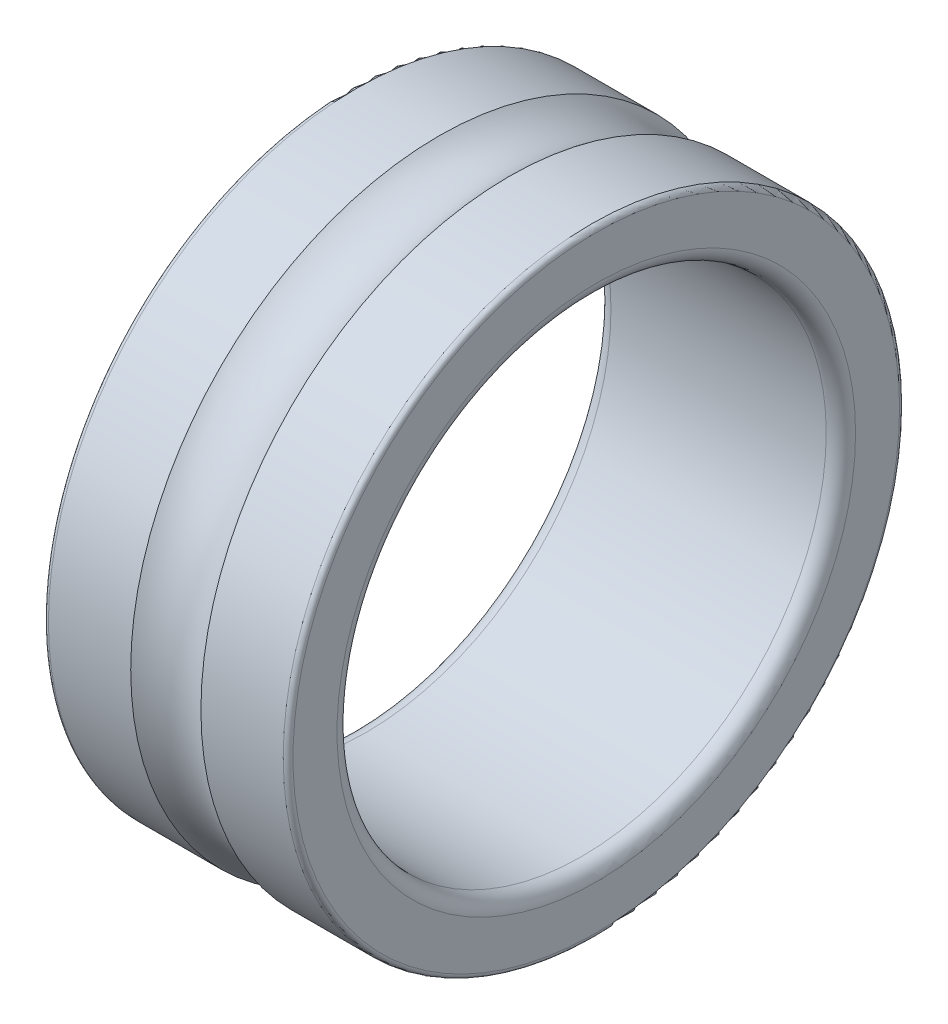
ISO-10303-21;
HEADER;
FILE_DESCRIPTION(('STEP AP214'),'2;1');
FILE_NAME('part.step','',(''),(''),'','','');
FILE_SCHEMA(('AUTOMOTIVE_DESIGN { 1 0 10303 214 1 1 1 1 }'));
ENDSEC;
DATA;
#1=APPLICATION_CONTEXT('core data for automotive mechanical design processes');
#2=APPLICATION_PROTOCOL_DEFINITION('international standard','automotive_design',2000,#1);
#3=PRODUCT_CONTEXT('',#1,'mechanical');
#4=PRODUCT('Part','Part','',(#3));
#5=PRODUCT_RELATED_PRODUCT_CATEGORY('part','',(#4));
#6=PRODUCT_DEFINITION_FORMATION('','',#4);
#7=PRODUCT_DEFINITION_CONTEXT('part definition',#1,'design');
#8=PRODUCT_DEFINITION('design','',#6,#7);
#9=PRODUCT_DEFINITION_SHAPE('','',#8);
#10=(LENGTH_UNIT() NAMED_UNIT(*) SI_UNIT(.MILLI.,.METRE.));
#11=(NAMED_UNIT(*) PLANE_ANGLE_UNIT() SI_UNIT($,.RADIAN.));
#12=(NAMED_UNIT(*) SI_UNIT($,.STERADIAN.) SOLID_ANGLE_UNIT());
#13=UNCERTAINTY_MEASURE_WITH_UNIT(LENGTH_MEASURE(1.E-05),#10,'distance_accuracy_value','');
#14=(GEOMETRIC_REPRESENTATION_CONTEXT(3) GLOBAL_UNCERTAINTY_ASSIGNED_CONTEXT((#13)) GLOBAL_UNIT_ASSIGNED_CONTEXT((#10,
#11,#12)) REPRESENTATION_CONTEXT('',''));
#15=CARTESIAN_POINT('',(0.,0.,0.));
#16=DIRECTION('',(0.,0.,1.));
#17=DIRECTION('',(1.,0.,0.));
#18=AXIS2_PLACEMENT_3D('',#15,#16,#17);
#19=CARTESIAN_POINT('',(0.,0.,0.));
#20=DIRECTION('',(1.,0.,0.));
#21=DIRECTION('',(0.,0.,-1.));
#22=AXIS2_PLACEMENT_3D('',#19,#20,#21);
#23=TOROIDAL_SURFACE('',#22,7.25,1.1905);
#24=CARTESIAN_POINT('',(-0.717488850087581,0.,0.));
#25=DIRECTION('',(-1.,0.,0.));
#26=DIRECTION('',(0.,0.,1.));
#27=AXIS2_PLACEMENT_3D('',#24,#25,#26);
#28=CIRCLE('',#27,6.3);
#29=CARTESIAN_POINT('',(-0.717488850087581,0.,6.3));
#30=VERTEX_POINT('',#29);
#31=EDGE_CURVE('E135',#30,#30,#28,.T.);
#32=ORIENTED_EDGE('',*,*,#31,.F.);
#33=EDGE_LOOP('',(#32));
#34=FACE_BOUND('',#33,.T.);
#35=CARTESIAN_POINT('',(0.717488850087582,0.,0.));
#36=DIRECTION('',(-1.,0.,0.));
#37=DIRECTION('',(0.,0.,1.));
#38=AXIS2_PLACEMENT_3D('',#35,#36,#37);
#39=CIRCLE('',#38,6.3);
#40=CARTESIAN_POINT('',(0.717488850087582,0.,6.3));
#41=VERTEX_POINT('',#40);
#42=EDGE_CURVE('E142',#41,#41,#39,.F.);
#43=ORIENTED_EDGE('',*,*,#42,.F.);
#44=EDGE_LOOP('',(#43));
#45=FACE_BOUND('',#44,.T.);
#46=ADVANCED_FACE('F14',(#34,#45),#23,.F.);
#47=CARTESIAN_POINT('',(2.2,0.,0.));
#48=DIRECTION('',(-1.,0.,0.));
#49=DIRECTION('',(0.,0.,1.));
#50=AXIS2_PLACEMENT_3D('',#47,#48,#49);
#51=CYLINDRICAL_SURFACE('',#50,6.3);
#52=CARTESIAN_POINT('',(2.4,0.,0.));
#53=DIRECTION('',(1.,0.,0.));
#54=DIRECTION('',(0.,0.,-1.));
#55=AXIS2_PLACEMENT_3D('',#52,#53,#54);
#56=CIRCLE('',#55,6.3);
#57=CARTESIAN_POINT('',(2.4,0.,-6.3));
#58=VERTEX_POINT('',#57);
#59=EDGE_CURVE('E108',#58,#58,#56,.T.);
#60=ORIENTED_EDGE('',*,*,#59,.F.);
#61=EDGE_LOOP('',(#60));
#62=FACE_BOUND('',#61,.T.);
#63=ORIENTED_EDGE('',*,*,#42,.T.);
#64=EDGE_LOOP('',(#63));
#65=FACE_BOUND('',#64,.T.);
#66=ADVANCED_FACE('F146',(#62,#65),#51,.T.);
#67=CARTESIAN_POINT('',(2.2,0.,0.));
#68=DIRECTION('',(-1.,0.,0.));
#69=DIRECTION('',(0.,0.,1.));
#70=AXIS2_PLACEMENT_3D('',#67,#68,#69);
#71=CYLINDRICAL_SURFACE('',#70,6.3);
#72=ORIENTED_EDGE('',*,*,#31,.T.);
#73=EDGE_LOOP('',(#72));
#74=FACE_BOUND('',#73,.T.);
#75=CARTESIAN_POINT('',(-2.4,0.,0.));
#76=DIRECTION('',(1.,0.,0.));
#77=DIRECTION('',(0.,0.,-1.));
#78=AXIS2_PLACEMENT_3D('',#75,#76,#77);
#79=CIRCLE('',#78,6.3);
#80=CARTESIAN_POINT('',(-2.4,0.,-6.3));
#81=VERTEX_POINT('',#80);
#82=EDGE_CURVE('E105',#81,#81,#79,.F.);
#83=ORIENTED_EDGE('',*,*,#82,.F.);
#84=EDGE_LOOP('',(#83));
#85=FACE_BOUND('',#84,.T.);
#86=ADVANCED_FACE('F129',(#74,#85),#71,.T.);
#87=CARTESIAN_POINT('',(2.4,0.,0.));
#88=DIRECTION('',(1.,0.,0.));
#89=DIRECTION('',(0.,0.,-1.));
#90=AXIS2_PLACEMENT_3D('',#87,#88,#89);
#91=TOROIDAL_SURFACE('',#90,6.2,0.1);
#92=CARTESIAN_POINT('',(2.5,0.,0.));
#93=DIRECTION('',(-1.,0.,0.));
#94=DIRECTION('',(0.,0.,-1.));
#95=AXIS2_PLACEMENT_3D('',#92,#93,#94);
#96=CIRCLE('',#95,6.2);
#97=CARTESIAN_POINT('',(2.5,0.,-6.2));
#98=VERTEX_POINT('',#97);
#99=EDGE_CURVE('E60',#98,#98,#96,.F.);
#100=ORIENTED_EDGE('',*,*,#99,.F.);
#101=EDGE_LOOP('',(#100));
#102=FACE_BOUND('',#101,.T.);
#103=ORIENTED_EDGE('',*,*,#59,.T.);
#104=EDGE_LOOP('',(#103));
#105=FACE_BOUND('',#104,.T.);
#106=ADVANCED_FACE('F125',(#102,#105),#91,.T.);
#107=CARTESIAN_POINT('',(-2.4,0.,0.));
#108=DIRECTION('',(1.,0.,0.));
#109=DIRECTION('',(0.,0.,-1.));
#110=AXIS2_PLACEMENT_3D('',#107,#108,#109);
#111=TOROIDAL_SURFACE('',#110,6.2,0.100000000000001);
#112=ORIENTED_EDGE('',*,*,#82,.T.);
#113=EDGE_LOOP('',(#112));
#114=FACE_BOUND('',#113,.T.);
#115=CARTESIAN_POINT('',(-2.5,0.,0.));
#116=DIRECTION('',(1.,0.,0.));
#117=DIRECTION('',(0.,0.,-1.));
#118=AXIS2_PLACEMENT_3D('',#115,#116,#117);
#119=CIRCLE('',#118,6.2);
#120=CARTESIAN_POINT('',(-2.5,0.,-6.2));
#121=VERTEX_POINT('',#120);
#122=EDGE_CURVE('E113',#121,#121,#119,.F.);
#123=ORIENTED_EDGE('',*,*,#122,.F.);
#124=EDGE_LOOP('',(#123));
#125=FACE_BOUND('',#124,.T.);
#126=ADVANCED_FACE('F77',(#114,#125),#111,.T.);
#127=CARTESIAN_POINT('',(2.5,5.3,0.));
#128=DIRECTION('',(1.,0.,0.));
#129=DIRECTION('',(0.,0.,-1.));
#130=AXIS2_PLACEMENT_3D('',#127,#128,#129);
#131=PLANE('',#130);
#132=CARTESIAN_POINT('',(2.5,0.,0.));
#133=DIRECTION('',(1.,0.,0.));
#134=DIRECTION('',(0.,0.,-1.));
#135=AXIS2_PLACEMENT_3D('',#132,#133,#134);
#136=CIRCLE('',#135,5.3);
#137=CARTESIAN_POINT('',(2.5,0.,-5.3));
#138=VERTEX_POINT('',#137);
#139=EDGE_CURVE('E95',#138,#138,#136,.T.);
#140=ORIENTED_EDGE('',*,*,#139,.F.);
#141=EDGE_LOOP('',(#140));
#142=FACE_BOUND('',#141,.T.);
#143=ORIENTED_EDGE('',*,*,#99,.T.);
#144=EDGE_LOOP('',(#143));
#145=FACE_BOUND('',#144,.T.);
#146=ADVANCED_FACE('F67',(#142,#145),#131,.T.);
#147=CARTESIAN_POINT('',(-2.5,6.2,0.));
#148=DIRECTION('',(-1.,0.,0.));
#149=DIRECTION('',(0.,0.,1.));
#150=AXIS2_PLACEMENT_3D('',#147,#148,#149);
#151=PLANE('',#150);
#152=ORIENTED_EDGE('',*,*,#122,.T.);
#153=EDGE_LOOP('',(#152));
#154=FACE_BOUND('',#153,.T.);
#155=CARTESIAN_POINT('',(-2.5,0.,0.));
#156=DIRECTION('',(-1.,0.,0.));
#157=DIRECTION('',(0.,0.,-1.));
#158=AXIS2_PLACEMENT_3D('',#155,#156,#157);
#159=CIRCLE('',#158,5.3);
#160=CARTESIAN_POINT('',(-2.5,0.,-5.3));
#161=VERTEX_POINT('',#160);
#162=EDGE_CURVE('E26',#161,#161,#159,.T.);
#163=ORIENTED_EDGE('',*,*,#162,.F.);
#164=EDGE_LOOP('',(#163));
#165=FACE_BOUND('',#164,.T.);
#166=ADVANCED_FACE('F76',(#154,#165),#151,.T.);
#167=CARTESIAN_POINT('',(2.2,0.,0.));
#168=DIRECTION('',(1.,0.,0.));
#169=DIRECTION('',(0.,0.,-1.));
#170=AXIS2_PLACEMENT_3D('',#167,#168,#169);
#171=TOROIDAL_SURFACE('',#170,5.3,0.300000000000003);
#172=CARTESIAN_POINT('',(2.2,0.,0.));
#173=DIRECTION('',(-1.,0.,0.));
#174=DIRECTION('',(0.,0.,1.));
#175=AXIS2_PLACEMENT_3D('',#172,#173,#174);
#176=CIRCLE('',#175,5.);
#177=CARTESIAN_POINT('',(2.2,0.,5.));
#178=VERTEX_POINT('',#177);
#179=EDGE_CURVE('E21',#178,#178,#176,.T.);
#180=ORIENTED_EDGE('',*,*,#179,.T.);
#181=EDGE_LOOP('',(#180));
#182=FACE_BOUND('',#181,.T.);
#183=ORIENTED_EDGE('',*,*,#139,.T.);
#184=EDGE_LOOP('',(#183));
#185=FACE_BOUND('',#184,.T.);
#186=ADVANCED_FACE('F40',(#182,#185),#171,.T.);
#187=CARTESIAN_POINT('',(-2.2,0.,0.));
#188=DIRECTION('',(1.,0.,0.));
#189=DIRECTION('',(0.,0.,-1.));
#190=AXIS2_PLACEMENT_3D('',#187,#188,#189);
#191=TOROIDAL_SURFACE('',#190,5.3,0.300000000000002);
#192=ORIENTED_EDGE('',*,*,#162,.T.);
#193=EDGE_LOOP('',(#192));
#194=FACE_BOUND('',#193,.T.);
#195=CARTESIAN_POINT('',(-2.2,0.,0.));
#196=DIRECTION('',(-1.,0.,0.));
#197=DIRECTION('',(0.,0.,1.));
#198=AXIS2_PLACEMENT_3D('',#195,#196,#197);
#199=CIRCLE('',#198,5.);
#200=CARTESIAN_POINT('',(-2.2,0.,5.));
#201=VERTEX_POINT('',#200);
#202=EDGE_CURVE('E10',#201,#201,#199,.F.);
#203=ORIENTED_EDGE('',*,*,#202,.T.);
#204=EDGE_LOOP('',(#203));
#205=FACE_BOUND('',#204,.T.);
#206=ADVANCED_FACE('F34',(#194,#205),#191,.T.);
#207=CARTESIAN_POINT('',(2.2,0.,0.));
#208=DIRECTION('',(-1.,0.,0.));
#209=DIRECTION('',(0.,0.,1.));
#210=AXIS2_PLACEMENT_3D('',#207,#208,#209);
#211=CYLINDRICAL_SURFACE('',#210,5.);
#212=ORIENTED_EDGE('',*,*,#202,.F.);
#213=EDGE_LOOP('',(#212));
#214=FACE_BOUND('',#213,.T.);
#215=ORIENTED_EDGE('',*,*,#179,.F.);
#216=EDGE_LOOP('',(#215));
#217=FACE_BOUND('',#216,.T.);
#218=ADVANCED_FACE('F39',(#214,#217),#211,.F.);
#219=CLOSED_SHELL('',(#46,#66,#86,#106,#126,#146,#166,#186,#206,#218));
#220=MANIFOLD_SOLID_BREP('B1',#219);
#221=ADVANCED_BREP_SHAPE_REPRESENTATION('',(#18,#220),#14);
#222=SHAPE_DEFINITION_REPRESENTATION(#9,#221);
ENDSEC;
END-ISO-10303-21;
